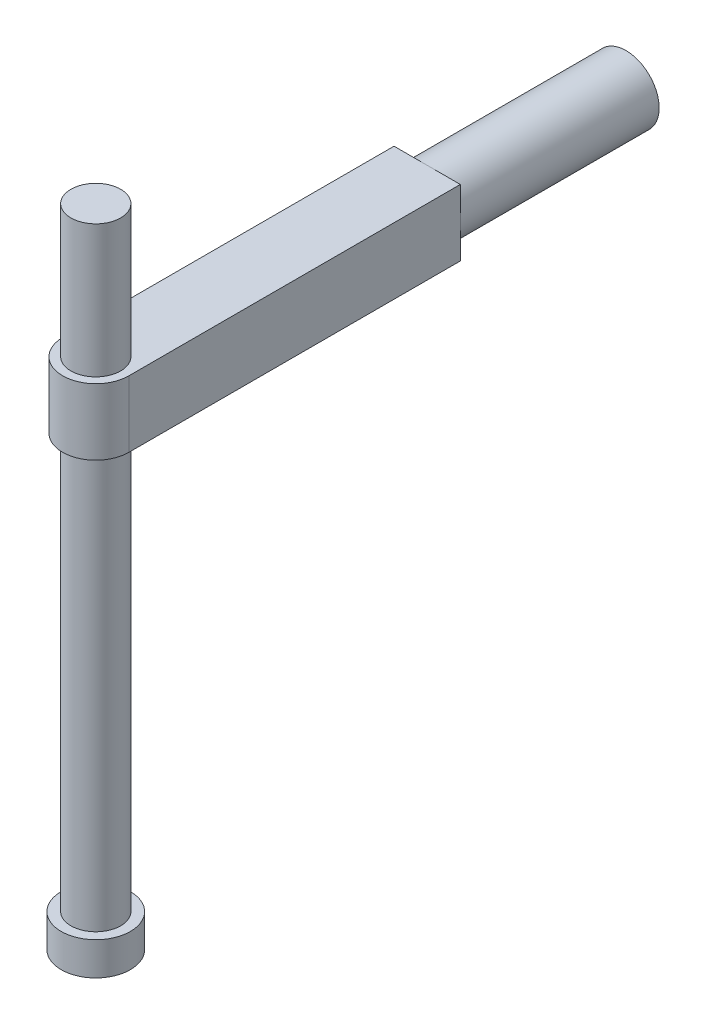
ISO-10303-21;
HEADER;
FILE_DESCRIPTION(('STEP AP214'),'2;1');
FILE_NAME('part.step','',(''),(''),'','','');
FILE_SCHEMA(('AUTOMOTIVE_DESIGN { 1 0 10303 214 1 1 1 1 }'));
ENDSEC;
DATA;
#1=APPLICATION_CONTEXT('core data for automotive mechanical design processes');
#2=APPLICATION_PROTOCOL_DEFINITION('international standard','automotive_design',2000,#1);
#3=PRODUCT_CONTEXT('',#1,'mechanical');
#4=PRODUCT('Part','Part','',(#3));
#5=PRODUCT_RELATED_PRODUCT_CATEGORY('part','',(#4));
#6=PRODUCT_DEFINITION_FORMATION('','',#4);
#7=PRODUCT_DEFINITION_CONTEXT('part definition',#1,'design');
#8=PRODUCT_DEFINITION('design','',#6,#7);
#9=PRODUCT_DEFINITION_SHAPE('','',#8);
#10=(LENGTH_UNIT() NAMED_UNIT(*) SI_UNIT(.MILLI.,.METRE.));
#11=(NAMED_UNIT(*) PLANE_ANGLE_UNIT() SI_UNIT($,.RADIAN.));
#12=(NAMED_UNIT(*) SI_UNIT($,.STERADIAN.) SOLID_ANGLE_UNIT());
#13=UNCERTAINTY_MEASURE_WITH_UNIT(LENGTH_MEASURE(1.E-05),#10,'distance_accuracy_value','');
#14=(GEOMETRIC_REPRESENTATION_CONTEXT(3) GLOBAL_UNCERTAINTY_ASSIGNED_CONTEXT((#13)) GLOBAL_UNIT_ASSIGNED_CONTEXT((#10,
#11,#12)) REPRESENTATION_CONTEXT('',''));
#15=CARTESIAN_POINT('',(0.,0.,0.));
#16=DIRECTION('',(0.,0.,1.));
#17=DIRECTION('',(1.,0.,0.));
#18=AXIS2_PLACEMENT_3D('',#15,#16,#17);
#19=CARTESIAN_POINT('',(-2.,-27.,-20.));
#20=DIRECTION('',(0.,0.,1.));
#21=DIRECTION('',(1.,0.,0.));
#22=AXIS2_PLACEMENT_3D('',#19,#20,#21);
#23=PLANE('',#22);
#24=CARTESIAN_POINT('',(0.,2.,-20.));
#25=DIRECTION('',(0.,0.,-1.));
#26=DIRECTION('',(-1.,0.,0.));
#27=AXIS2_PLACEMENT_3D('',#24,#25,#26);
#28=CIRCLE('',#27,2.);
#29=CARTESIAN_POINT('',(-2.,2.,-20.));
#30=VERTEX_POINT('',#29);
#31=CARTESIAN_POINT('',(0.,4.,-20.));
#32=VERTEX_POINT('',#31);
#33=EDGE_CURVE('E45',#30,#32,#28,.T.);
#34=ORIENTED_EDGE('',*,*,#33,.F.);
#35=DIRECTION('',(0.,-1.,0.));
#36=VECTOR('',#35,1.);
#37=CARTESIAN_POINT('',(-2.,4.,-20.));
#38=LINE('',#37,#36);
#39=CARTESIAN_POINT('',(-2.,4.,-20.));
#40=VERTEX_POINT('',#39);
#41=EDGE_CURVE('E88',#40,#30,#38,.T.);
#42=ORIENTED_EDGE('',*,*,#41,.F.);
#43=DIRECTION('',(1.,0.,0.));
#44=VECTOR('',#43,1.);
#45=CARTESIAN_POINT('',(-2.,4.,-20.));
#46=LINE('',#45,#44);
#47=EDGE_CURVE('E109',#40,#32,#46,.T.);
#48=ORIENTED_EDGE('',*,*,#47,.T.);
#49=EDGE_LOOP('',(#34,#42,#48));
#50=FACE_BOUND('',#49,.T.);
#51=ADVANCED_FACE('F34',(#50),#23,.F.);
#52=CARTESIAN_POINT('',(2.,2.,-20.));
#53=VERTEX_POINT('',#52);
#54=EDGE_CURVE('E11',#32,#53,#28,.T.);
#55=ORIENTED_EDGE('',*,*,#54,.F.);
#56=CARTESIAN_POINT('',(2.,4.,-20.));
#57=VERTEX_POINT('',#56);
#58=EDGE_CURVE('E118',#32,#57,#46,.T.);
#59=ORIENTED_EDGE('',*,*,#58,.T.);
#60=DIRECTION('',(0.,-1.,0.));
#61=VECTOR('',#60,1.);
#62=CARTESIAN_POINT('',(2.,4.,-20.));
#63=LINE('',#62,#61);
#64=EDGE_CURVE('E152',#57,#53,#63,.T.);
#65=ORIENTED_EDGE('',*,*,#64,.T.);
#66=EDGE_LOOP('',(#55,#59,#65));
#67=FACE_BOUND('',#66,.T.);
#68=ADVANCED_FACE('F177',(#67),#23,.F.);
#69=CARTESIAN_POINT('',(0.,0.,-20.));
#70=VERTEX_POINT('',#69);
#71=EDGE_CURVE('E43',#53,#70,#28,.T.);
#72=ORIENTED_EDGE('',*,*,#71,.F.);
#73=CARTESIAN_POINT('',(2.,0.,-20.));
#74=VERTEX_POINT('',#73);
#75=EDGE_CURVE('E99',#53,#74,#63,.T.);
#76=ORIENTED_EDGE('',*,*,#75,.T.);
#77=DIRECTION('',(1.,0.,0.));
#78=VECTOR('',#77,1.);
#79=CARTESIAN_POINT('',(0.,0.,-20.));
#80=LINE('',#79,#78);
#81=EDGE_CURVE('E113',#70,#74,#80,.T.);
#82=ORIENTED_EDGE('',*,*,#81,.F.);
#83=EDGE_LOOP('',(#72,#76,#82));
#84=FACE_BOUND('',#83,.T.);
#85=ADVANCED_FACE('F182',(#84),#23,.F.);
#86=CARTESIAN_POINT('',(0.,4.,0.));
#87=DIRECTION('',(0.,-1.,0.));
#88=DIRECTION('',(0.,0.,-1.));
#89=AXIS2_PLACEMENT_3D('',#86,#87,#88);
#90=CYLINDRICAL_SURFACE('',#89,2.);
#91=CARTESIAN_POINT('',(0.,0.,0.));
#92=DIRECTION('',(0.,1.,0.));
#93=DIRECTION('',(0.,0.,1.));
#94=AXIS2_PLACEMENT_3D('',#91,#92,#93);
#95=CIRCLE('',#94,2.);
#96=CARTESIAN_POINT('',(-2.,0.,0.));
#97=VERTEX_POINT('',#96);
#98=CARTESIAN_POINT('',(2.,0.,0.));
#99=VERTEX_POINT('',#98);
#100=EDGE_CURVE('E143',#97,#99,#95,.T.);
#101=ORIENTED_EDGE('',*,*,#100,.T.);
#102=DIRECTION('',(0.,-1.,0.));
#103=VECTOR('',#102,1.);
#104=CARTESIAN_POINT('',(2.,4.,0.));
#105=LINE('',#104,#103);
#106=CARTESIAN_POINT('',(2.,4.,0.));
#107=VERTEX_POINT('',#106);
#108=EDGE_CURVE('E134',#107,#99,#105,.T.);
#109=ORIENTED_EDGE('',*,*,#108,.F.);
#110=CARTESIAN_POINT('',(0.,4.,0.));
#111=DIRECTION('',(0.,1.,0.));
#112=DIRECTION('',(0.,0.,1.));
#113=AXIS2_PLACEMENT_3D('',#110,#111,#112);
#114=CIRCLE('',#113,2.);
#115=CARTESIAN_POINT('',(-2.,4.,0.));
#116=VERTEX_POINT('',#115);
#117=EDGE_CURVE('E135',#116,#107,#114,.T.);
#118=ORIENTED_EDGE('',*,*,#117,.F.);
#119=DIRECTION('',(0.,-1.,0.));
#120=VECTOR('',#119,1.);
#121=CARTESIAN_POINT('',(-2.,4.,0.));
#122=LINE('',#121,#120);
#123=EDGE_CURVE('E107',#116,#97,#122,.T.);
#124=ORIENTED_EDGE('',*,*,#123,.T.);
#125=EDGE_LOOP('',(#101,#109,#118,#124));
#126=FACE_BOUND('',#125,.T.);
#127=ADVANCED_FACE('F36',(#126),#90,.T.);
#128=CARTESIAN_POINT('',(2.,4.,0.));
#129=DIRECTION('',(-1.,0.,0.));
#130=DIRECTION('',(0.,0.,1.));
#131=AXIS2_PLACEMENT_3D('',#128,#129,#130);
#132=PLANE('',#131);
#133=DIRECTION('',(0.,0.,-1.));
#134=VECTOR('',#133,1.);
#135=CARTESIAN_POINT('',(2.,0.,0.));
#136=LINE('',#135,#134);
#137=EDGE_CURVE('E146',#99,#74,#136,.T.);
#138=ORIENTED_EDGE('',*,*,#137,.T.);
#139=ORIENTED_EDGE('',*,*,#75,.F.);
#140=ORIENTED_EDGE('',*,*,#64,.F.);
#141=DIRECTION('',(0.,0.,-1.));
#142=VECTOR('',#141,1.);
#143=CARTESIAN_POINT('',(2.,4.,0.));
#144=LINE('',#143,#142);
#145=EDGE_CURVE('E138',#107,#57,#144,.T.);
#146=ORIENTED_EDGE('',*,*,#145,.F.);
#147=ORIENTED_EDGE('',*,*,#108,.T.);
#148=EDGE_LOOP('',(#138,#139,#140,#146,#147));
#149=FACE_BOUND('',#148,.T.);
#150=ADVANCED_FACE('F200',(#149),#132,.F.);
#151=CARTESIAN_POINT('',(-2.,4.,0.));
#152=DIRECTION('',(1.,0.,0.));
#153=DIRECTION('',(0.,0.,-1.));
#154=AXIS2_PLACEMENT_3D('',#151,#152,#153);
#155=PLANE('',#154);
#156=DIRECTION('',(0.,0.,1.));
#157=VECTOR('',#156,1.);
#158=CARTESIAN_POINT('',(-2.,0.,0.));
#159=LINE('',#158,#157);
#160=CARTESIAN_POINT('',(-2.,0.,-20.));
#161=VERTEX_POINT('',#160);
#162=EDGE_CURVE('E139',#161,#97,#159,.T.);
#163=ORIENTED_EDGE('',*,*,#162,.T.);
#164=ORIENTED_EDGE('',*,*,#123,.F.);
#165=DIRECTION('',(0.,0.,1.));
#166=VECTOR('',#165,1.);
#167=CARTESIAN_POINT('',(-2.,4.,0.));
#168=LINE('',#167,#166);
#169=EDGE_CURVE('E94',#40,#116,#168,.T.);
#170=ORIENTED_EDGE('',*,*,#169,.F.);
#171=ORIENTED_EDGE('',*,*,#41,.T.);
#172=EDGE_CURVE('E91',#30,#161,#38,.T.);
#173=ORIENTED_EDGE('',*,*,#172,.T.);
#174=EDGE_LOOP('',(#163,#164,#170,#171,#173));
#175=FACE_BOUND('',#174,.T.);
#176=ADVANCED_FACE('F90',(#175),#155,.F.);
#177=CARTESIAN_POINT('',(0.,4.,0.));
#178=DIRECTION('',(0.,1.,0.));
#179=DIRECTION('',(0.,0.,1.));
#180=AXIS2_PLACEMENT_3D('',#177,#178,#179);
#181=PLANE('',#180);
#182=ORIENTED_EDGE('',*,*,#47,.F.);
#183=ORIENTED_EDGE('',*,*,#169,.T.);
#184=ORIENTED_EDGE('',*,*,#117,.T.);
#185=ORIENTED_EDGE('',*,*,#145,.T.);
#186=ORIENTED_EDGE('',*,*,#58,.F.);
#187=EDGE_LOOP('',(#182,#183,#184,#185,#186));
#188=FACE_BOUND('',#187,.T.);
#189=CARTESIAN_POINT('',(0.,4.,0.));
#190=DIRECTION('',(0.,1.,0.));
#191=DIRECTION('',(0.,0.,1.));
#192=AXIS2_PLACEMENT_3D('',#189,#190,#191);
#193=CIRCLE('',#192,1.5);
#194=CARTESIAN_POINT('',(0.,4.,1.5));
#195=VERTEX_POINT('',#194);
#196=EDGE_CURVE('E131',#195,#195,#193,.T.);
#197=ORIENTED_EDGE('',*,*,#196,.F.);
#198=EDGE_LOOP('',(#197));
#199=FACE_BOUND('',#198,.T.);
#200=ADVANCED_FACE('F172',(#188,#199),#181,.T.);
#201=CARTESIAN_POINT('',(0.,0.,0.));
#202=DIRECTION('',(0.,1.,0.));
#203=DIRECTION('',(0.,0.,1.));
#204=AXIS2_PLACEMENT_3D('',#201,#202,#203);
#205=PLANE('',#204);
#206=CARTESIAN_POINT('',(0.,0.,0.));
#207=DIRECTION('',(0.,1.,0.));
#208=DIRECTION('',(0.,0.,1.));
#209=AXIS2_PLACEMENT_3D('',#206,#207,#208);
#210=CIRCLE('',#209,1.5);
#211=CARTESIAN_POINT('',(0.,0.,1.5));
#212=VERTEX_POINT('',#211);
#213=EDGE_CURVE('E130',#212,#212,#210,.T.);
#214=ORIENTED_EDGE('',*,*,#213,.T.);
#215=EDGE_LOOP('',(#214));
#216=FACE_BOUND('',#215,.T.);
#217=ORIENTED_EDGE('',*,*,#162,.F.);
#218=EDGE_CURVE('E38',#161,#70,#80,.T.);
#219=ORIENTED_EDGE('',*,*,#218,.T.);
#220=ORIENTED_EDGE('',*,*,#81,.T.);
#221=ORIENTED_EDGE('',*,*,#137,.F.);
#222=ORIENTED_EDGE('',*,*,#100,.F.);
#223=EDGE_LOOP('',(#217,#219,#220,#221,#222));
#224=FACE_BOUND('',#223,.T.);
#225=ADVANCED_FACE('F158',(#216,#224),#205,.F.);
#226=CARTESIAN_POINT('',(0.,-25.,0.));
#227=DIRECTION('',(0.,1.,0.));
#228=DIRECTION('',(0.,0.,1.));
#229=AXIS2_PLACEMENT_3D('',#226,#227,#228);
#230=CYLINDRICAL_SURFACE('',#229,1.5);
#231=CARTESIAN_POINT('',(0.,-25.,0.));
#232=DIRECTION('',(0.,-1.,0.));
#233=DIRECTION('',(0.,0.,-1.));
#234=AXIS2_PLACEMENT_3D('',#231,#232,#233);
#235=CIRCLE('',#234,1.5);
#236=CARTESIAN_POINT('',(0.,-25.,-1.5));
#237=VERTEX_POINT('',#236);
#238=EDGE_CURVE('E122',#237,#237,#235,.F.);
#239=ORIENTED_EDGE('',*,*,#238,.T.);
#240=EDGE_LOOP('',(#239));
#241=FACE_BOUND('',#240,.T.);
#242=ORIENTED_EDGE('',*,*,#213,.F.);
#243=EDGE_LOOP('',(#242));
#244=FACE_BOUND('',#243,.T.);
#245=ADVANCED_FACE('F161',(#241,#244),#230,.T.);
#246=ORIENTED_EDGE('',*,*,#196,.T.);
#247=EDGE_LOOP('',(#246));
#248=FACE_BOUND('',#247,.T.);
#249=CARTESIAN_POINT('',(0.,12.,0.));
#250=DIRECTION('',(0.,1.,0.));
#251=DIRECTION('',(0.,0.,1.));
#252=AXIS2_PLACEMENT_3D('',#249,#250,#251);
#253=CIRCLE('',#252,1.5);
#254=CARTESIAN_POINT('',(0.,12.,1.5));
#255=VERTEX_POINT('',#254);
#256=EDGE_CURVE('E127',#255,#255,#253,.T.);
#257=ORIENTED_EDGE('',*,*,#256,.F.);
#258=EDGE_LOOP('',(#257));
#259=FACE_BOUND('',#258,.T.);
#260=ADVANCED_FACE('F163',(#248,#259),#230,.T.);
#261=CARTESIAN_POINT('',(0.,12.,0.));
#262=DIRECTION('',(0.,1.,0.));
#263=DIRECTION('',(0.,0.,1.));
#264=AXIS2_PLACEMENT_3D('',#261,#262,#263);
#265=PLANE('',#264);
#266=ORIENTED_EDGE('',*,*,#256,.T.);
#267=EDGE_LOOP('',(#266));
#268=FACE_BOUND('',#267,.T.);
#269=ADVANCED_FACE('F170',(#268),#265,.T.);
#270=CARTESIAN_POINT('',(0.,-27.,0.));
#271=DIRECTION('',(0.,1.,0.));
#272=DIRECTION('',(0.,0.,1.));
#273=AXIS2_PLACEMENT_3D('',#270,#271,#272);
#274=CYLINDRICAL_SURFACE('',#273,2.08606003327739);
#275=CARTESIAN_POINT('',(0.,-27.,0.));
#276=DIRECTION('',(0.,-1.,0.));
#277=DIRECTION('',(0.,0.,-1.));
#278=AXIS2_PLACEMENT_3D('',#275,#276,#277);
#279=CIRCLE('',#278,2.08606003327739);
#280=CARTESIAN_POINT('',(0.,-27.,-2.08606003327739));
#281=VERTEX_POINT('',#280);
#282=EDGE_CURVE('E119',#281,#281,#279,.T.);
#283=ORIENTED_EDGE('',*,*,#282,.F.);
#284=EDGE_LOOP('',(#283));
#285=FACE_BOUND('',#284,.T.);
#286=CARTESIAN_POINT('',(0.,-25.,0.));
#287=DIRECTION('',(0.,-1.,0.));
#288=DIRECTION('',(0.,0.,-1.));
#289=AXIS2_PLACEMENT_3D('',#286,#287,#288);
#290=CIRCLE('',#289,2.08606003327739);
#291=CARTESIAN_POINT('',(0.,-25.,-2.08606003327739));
#292=VERTEX_POINT('',#291);
#293=EDGE_CURVE('E117',#292,#292,#290,.T.);
#294=ORIENTED_EDGE('',*,*,#293,.T.);
#295=EDGE_LOOP('',(#294));
#296=FACE_BOUND('',#295,.T.);
#297=ADVANCED_FACE('F286',(#285,#296),#274,.T.);
#298=CARTESIAN_POINT('',(0.,-27.,0.));
#299=DIRECTION('',(0.,-1.,0.));
#300=DIRECTION('',(0.,0.,-1.));
#301=AXIS2_PLACEMENT_3D('',#298,#299,#300);
#302=PLANE('',#301);
#303=ORIENTED_EDGE('',*,*,#282,.T.);
#304=EDGE_LOOP('',(#303));
#305=FACE_BOUND('',#304,.T.);
#306=ADVANCED_FACE('F193',(#305),#302,.T.);
#307=CARTESIAN_POINT('',(0.,-25.,0.));
#308=DIRECTION('',(0.,-1.,0.));
#309=DIRECTION('',(0.,0.,-1.));
#310=AXIS2_PLACEMENT_3D('',#307,#308,#309);
#311=PLANE('',#310);
#312=ORIENTED_EDGE('',*,*,#238,.F.);
#313=EDGE_LOOP('',(#312));
#314=FACE_BOUND('',#313,.T.);
#315=ORIENTED_EDGE('',*,*,#293,.F.);
#316=EDGE_LOOP('',(#315));
#317=FACE_BOUND('',#316,.T.);
#318=ADVANCED_FACE('F186',(#314,#317),#311,.F.);
#319=EDGE_CURVE('E104',#70,#30,#28,.T.);
#320=ORIENTED_EDGE('',*,*,#319,.F.);
#321=ORIENTED_EDGE('',*,*,#218,.F.);
#322=ORIENTED_EDGE('',*,*,#172,.F.);
#323=EDGE_LOOP('',(#320,#321,#322));
#324=FACE_BOUND('',#323,.T.);
#325=ADVANCED_FACE('F102',(#324),#23,.F.);
#326=CARTESIAN_POINT('',(0.,2.,-32.));
#327=DIRECTION('',(0.,0.,1.));
#328=DIRECTION('',(1.,0.,0.));
#329=AXIS2_PLACEMENT_3D('',#326,#327,#328);
#330=CYLINDRICAL_SURFACE('',#329,2.);
#331=CARTESIAN_POINT('',(0.,2.,-32.));
#332=DIRECTION('',(0.,0.,-1.));
#333=DIRECTION('',(-1.,0.,0.));
#334=AXIS2_PLACEMENT_3D('',#331,#332,#333);
#335=CIRCLE('',#334,2.);
#336=CARTESIAN_POINT('',(-2.,2.,-32.));
#337=VERTEX_POINT('',#336);
#338=EDGE_CURVE('E111',#337,#337,#335,.T.);
#339=ORIENTED_EDGE('',*,*,#338,.F.);
#340=EDGE_LOOP('',(#339));
#341=FACE_BOUND('',#340,.T.);
#342=ORIENTED_EDGE('',*,*,#33,.T.);
#343=ORIENTED_EDGE('',*,*,#54,.T.);
#344=ORIENTED_EDGE('',*,*,#71,.T.);
#345=ORIENTED_EDGE('',*,*,#319,.T.);
#346=EDGE_LOOP('',(#342,#343,#344,#345));
#347=FACE_BOUND('',#346,.T.);
#348=ADVANCED_FACE('F112',(#341,#347),#330,.T.);
#349=CARTESIAN_POINT('',(0.,2.,-32.));
#350=DIRECTION('',(0.,0.,-1.));
#351=DIRECTION('',(-1.,0.,0.));
#352=AXIS2_PLACEMENT_3D('',#349,#350,#351);
#353=PLANE('',#352);
#354=ORIENTED_EDGE('',*,*,#338,.T.);
#355=EDGE_LOOP('',(#354));
#356=FACE_BOUND('',#355,.T.);
#357=ADVANCED_FACE('F191',(#356),#353,.T.);
#358=CLOSED_SHELL('',(#51,#68,#85,#127,#150,#176,#200,#225,#245,#260,#269,#297,#306,#318,#325,
#348,#357));
#359=MANIFOLD_SOLID_BREP('B2',#358);
#360=ADVANCED_BREP_SHAPE_REPRESENTATION('',(#18,#359),#14);
#361=SHAPE_DEFINITION_REPRESENTATION(#9,#360);
ENDSEC;
END-ISO-10303-21;
